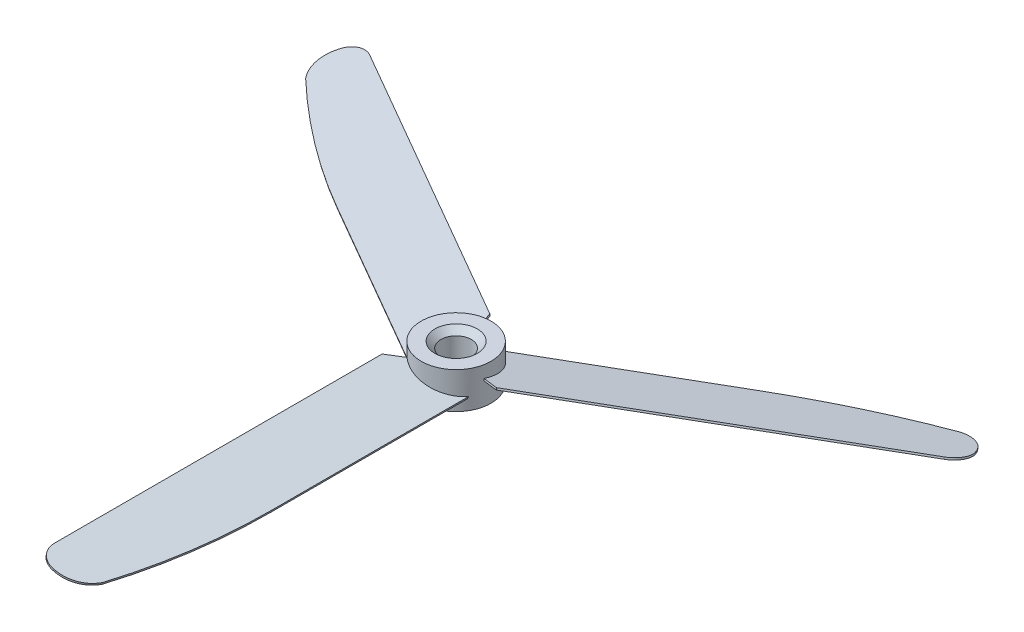
ISO-10303-21;
HEADER;
FILE_DESCRIPTION(('STEP AP214'),'2;1');
FILE_NAME('part.step','',(''),(''),'','','');
FILE_SCHEMA(('AUTOMOTIVE_DESIGN { 1 0 10303 214 1 1 1 1 }'));
ENDSEC;
DATA;
#1=APPLICATION_CONTEXT('core data for automotive mechanical design processes');
#2=APPLICATION_PROTOCOL_DEFINITION('international standard','automotive_design',2000,#1);
#3=PRODUCT_CONTEXT('',#1,'mechanical');
#4=PRODUCT('Part','Part','',(#3));
#5=PRODUCT_RELATED_PRODUCT_CATEGORY('part','',(#4));
#6=PRODUCT_DEFINITION_FORMATION('','',#4);
#7=PRODUCT_DEFINITION_CONTEXT('part definition',#1,'design');
#8=PRODUCT_DEFINITION('design','',#6,#7);
#9=PRODUCT_DEFINITION_SHAPE('','',#8);
#10=(LENGTH_UNIT() NAMED_UNIT(*) SI_UNIT(.MILLI.,.METRE.));
#11=(NAMED_UNIT(*) PLANE_ANGLE_UNIT() SI_UNIT($,.RADIAN.));
#12=(NAMED_UNIT(*) SI_UNIT($,.STERADIAN.) SOLID_ANGLE_UNIT());
#13=UNCERTAINTY_MEASURE_WITH_UNIT(LENGTH_MEASURE(1.E-05),#10,'distance_accuracy_value','');
#14=(GEOMETRIC_REPRESENTATION_CONTEXT(3) GLOBAL_UNCERTAINTY_ASSIGNED_CONTEXT((#13)) GLOBAL_UNIT_ASSIGNED_CONTEXT((#10,
#11,#12)) REPRESENTATION_CONTEXT('',''));
#15=CARTESIAN_POINT('',(0.,0.,0.));
#16=DIRECTION('',(0.,0.,1.));
#17=DIRECTION('',(1.,0.,0.));
#18=AXIS2_PLACEMENT_3D('',#15,#16,#17);
#19=CARTESIAN_POINT('',(0.,3.,0.));
#20=DIRECTION('',(0.,-1.,0.));
#21=DIRECTION('',(0.,0.,-1.));
#22=AXIS2_PLACEMENT_3D('',#19,#20,#21);
#23=CYLINDRICAL_SURFACE('',#22,5.75);
#24=CARTESIAN_POINT('',(0.,-22.4093869140777,0.));
#25=DIRECTION('',(0.487185032392622,0.224951054343865,0.843829228791101));
#26=DIRECTION('',(0.112475527171934,-0.974370064785235,0.194813327669881));
#27=AXIS2_PLACEMENT_3D('',#24,#25,#26);
#28=ELLIPSE('',#27,25.5611160248683,5.75);
#29=CARTESIAN_POINT('',(0.197285022953367,-1.28013719696289,-5.74661453550856));
#30=VERTEX_POINT('',#29);
#31=CARTESIAN_POINT('',(0.0674920929838222,-0.98782617752732,-5.74960388351969));
#32=VERTEX_POINT('',#31);
#33=EDGE_CURVE('E377',#30,#32,#28,.T.);
#34=ORIENTED_EDGE('',*,*,#33,.F.);
#35=CARTESIAN_POINT('',(0.,-0.153945616169009,0.));
#36=DIRECTION('',(0.112475527171934,-0.974370064785235,0.194813327669881));
#37=DIRECTION('',(-0.487185032392622,-0.224951054343865,-0.843829228791101));
#38=AXIS2_PLACEMENT_3D('',#35,#36,#37);
#39=ELLIPSE('',#38,5.901248619812,5.75);
#40=CARTESIAN_POINT('',(5.64774539742744,0.713843578539819,1.07957025053359));
#41=VERTEX_POINT('',#40);
#42=EDGE_CURVE('E335',#30,#41,#39,.T.);
#43=ORIENTED_EDGE('',*,*,#42,.T.);
#44=CARTESIAN_POINT('',(0.,-3.08350988501672,0.));
#45=DIRECTION('',(0.28567586359455,-0.156070821999763,-0.945532230799049));
#46=DIRECTION('',(-0.0451388037442194,-0.987745867376988,0.14940076932942));
#47=AXIS2_PLACEMENT_3D('',#44,#45,#46);
#48=ELLIPSE('',#47,36.8422484505703,5.75);
#49=CARTESIAN_POINT('',(5.65649072099047,1.01338707280666,1.03276944346197));
#50=VERTEX_POINT('',#49);
#51=EDGE_CURVE('E323',#50,#41,#48,.T.);
#52=ORIENTED_EDGE('',*,*,#51,.F.);
#53=CARTESIAN_POINT('',(0.,0.153945616169009,0.));
#54=DIRECTION('',(0.112475527171934,-0.974370064785235,0.194813327669881));
#55=DIRECTION('',(-0.487185032392622,-0.224951054343865,-0.843829228791101));
#56=AXIS2_PLACEMENT_3D('',#53,#54,#55);
#57=ELLIPSE('',#56,5.901248619812,5.75);
#58=EDGE_CURVE('E292',#32,#50,#57,.T.);
#59=ORIENTED_EDGE('',*,*,#58,.F.);
#60=EDGE_LOOP('',(#34,#43,#52,#59));
#61=FACE_BOUND('',#60,.T.);
#62=CARTESIAN_POINT('',(0.,-22.4093869140777,0.));
#63=DIRECTION('',(-0.974370064785235,0.224951054343865,0.));
#64=DIRECTION('',(-0.224951054343865,-0.974370064785235,0.));
#65=AXIS2_PLACEMENT_3D('',#62,#63,#64);
#66=ELLIPSE('',#65,25.5611160248683,5.75);
#67=CARTESIAN_POINT('',(4.87807166203063,-1.28013719696289,3.04416110941811));
#68=VERTEX_POINT('',#67);
#69=CARTESIAN_POINT('',(4.94555697833379,-0.98782617752732,2.93325180883844));
#70=VERTEX_POINT('',#69);
#71=EDGE_CURVE('E465',#68,#70,#66,.T.);
#72=ORIENTED_EDGE('',*,*,#71,.F.);
#73=CARTESIAN_POINT('',(0.,-0.153945616169009,0.));
#74=DIRECTION('',(-0.224951054343865,-0.974370064785235,0.));
#75=DIRECTION('',(0.974370064785235,-0.224951054343865,0.));
#76=AXIS2_PLACEMENT_3D('',#73,#74,#75);
#77=ELLIPSE('',#76,5.901248619812,5.75);
#78=CARTESIAN_POINT('',(-3.75880796084576,0.71384357853982,4.35130586301199));
#79=VERTEX_POINT('',#78);
#80=EDGE_CURVE('E469',#68,#79,#77,.T.);
#81=ORIENTED_EDGE('',*,*,#80,.T.);
#82=CARTESIAN_POINT('',(0.,-3.08350988501672,0.));
#83=DIRECTION('',(0.676017000171669,-0.156070821999763,0.720168670520466));
#84=DIRECTION('',(-0.106815459712106,-0.987745867376988,-0.113791735403645));
#85=AXIS2_PLACEMENT_3D('',#82,#83,#84);
#86=ELLIPSE('',#85,36.8422484505703,5.75);
#87=CARTESIAN_POINT('',(-3.72264993478564,1.01338707280666,4.3822799389177));
#88=VERTEX_POINT('',#87);
#89=EDGE_CURVE('E461',#88,#79,#86,.T.);
#90=ORIENTED_EDGE('',*,*,#89,.F.);
#91=CARTESIAN_POINT('',(0.,0.153945616169009,0.));
#92=DIRECTION('',(-0.224951054343865,-0.974370064785235,0.));
#93=DIRECTION('',(0.974370064785235,-0.224951054343865,0.));
#94=AXIS2_PLACEMENT_3D('',#91,#92,#93);
#95=ELLIPSE('',#94,5.901248619812,5.75);
#96=EDGE_CURVE('E454',#70,#88,#95,.T.);
#97=ORIENTED_EDGE('',*,*,#96,.F.);
#98=EDGE_LOOP('',(#72,#81,#90,#97));
#99=FACE_BOUND('',#98,.T.);
#100=CARTESIAN_POINT('',(0.,3.,0.));
#101=DIRECTION('',(0.,1.,0.));
#102=DIRECTION('',(0.,0.,1.));
#103=AXIS2_PLACEMENT_3D('',#100,#101,#102);
#104=CIRCLE('',#103,5.75);
#105=CARTESIAN_POINT('',(0.,3.,5.75));
#106=VERTEX_POINT('',#105);
#107=EDGE_CURVE('E450',#106,#106,#104,.T.);
#108=ORIENTED_EDGE('',*,*,#107,.F.);
#109=EDGE_LOOP('',(#108));
#110=FACE_BOUND('',#109,.T.);
#111=CARTESIAN_POINT('',(0.,-3.,0.));
#112=DIRECTION('',(0.,1.,0.));
#113=DIRECTION('',(0.,0.,1.));
#114=AXIS2_PLACEMENT_3D('',#111,#112,#113);
#115=CIRCLE('',#114,5.75);
#116=CARTESIAN_POINT('',(0.,-3.,5.75));
#117=VERTEX_POINT('',#116);
#118=EDGE_CURVE('E449',#117,#117,#115,.T.);
#119=ORIENTED_EDGE('',*,*,#118,.T.);
#120=EDGE_LOOP('',(#119));
#121=FACE_BOUND('',#120,.T.);
#122=CARTESIAN_POINT('',(0.,-22.4093869140777,0.));
#123=DIRECTION('',(0.48718503239261,0.224951054343865,-0.843829228791107));
#124=DIRECTION('',(0.112475527171931,-0.974370064785235,-0.194813327669882));
#125=AXIS2_PLACEMENT_3D('',#122,#123,#124);
#126=ELLIPSE('',#125,25.5611160248683,5.75);
#127=CARTESIAN_POINT('',(-5.075356684984,-1.28013719696289,2.70245342609049));
#128=VERTEX_POINT('',#127);
#129=CARTESIAN_POINT('',(-5.01304907131761,-0.98782617752732,2.81635207468129));
#130=VERTEX_POINT('',#129);
#131=EDGE_CURVE('E58',#128,#130,#126,.T.);
#132=ORIENTED_EDGE('',*,*,#131,.F.);
#133=CARTESIAN_POINT('',(0.,-0.153945616169009,0.));
#134=DIRECTION('',(0.112475527171931,-0.974370064785235,-0.194813327669882));
#135=DIRECTION('',(-0.48718503239261,-0.224951054343865,0.843829228791108));
#136=AXIS2_PLACEMENT_3D('',#133,#134,#135);
#137=ELLIPSE('',#136,5.901248619812,5.75);
#138=CARTESIAN_POINT('',(-1.88893743658173,0.713843578539818,-5.43087611354559));
#139=VERTEX_POINT('',#138);
#140=EDGE_CURVE('E62',#128,#139,#137,.T.);
#141=ORIENTED_EDGE('',*,*,#140,.T.);
#142=CARTESIAN_POINT('',(0.,-3.08350988501672,0.));
#143=DIRECTION('',(-0.961692863766222,-0.156070821999763,0.225363560278591));
#144=DIRECTION('',(0.151954263456326,-0.987745867376988,-0.0356090339257766));
#145=AXIS2_PLACEMENT_3D('',#142,#143,#144);
#146=ELLIPSE('',#145,36.8422484505703,5.75);
#147=CARTESIAN_POINT('',(-1.93384078620488,1.01338707280666,-5.41504938237968));
#148=VERTEX_POINT('',#147);
#149=EDGE_CURVE('E199',#148,#139,#146,.T.);
#150=ORIENTED_EDGE('',*,*,#149,.F.);
#151=CARTESIAN_POINT('',(0.,0.153945616169009,0.));
#152=DIRECTION('',(0.112475527171931,-0.974370064785235,-0.194813327669882));
#153=DIRECTION('',(-0.48718503239261,-0.224951054343865,0.843829228791108));
#154=AXIS2_PLACEMENT_3D('',#151,#152,#153);
#155=ELLIPSE('',#154,5.901248619812,5.75);
#156=EDGE_CURVE('E201',#130,#148,#155,.T.);
#157=ORIENTED_EDGE('',*,*,#156,.F.);
#158=EDGE_LOOP('',(#132,#141,#150,#157));
#159=FACE_BOUND('',#158,.T.);
#160=ADVANCED_FACE('F41',(#61,#99,#110,#121,#159),#23,.T.);
#161=CARTESIAN_POINT('',(0.,3.,0.));
#162=DIRECTION('',(0.,1.,0.));
#163=DIRECTION('',(0.,0.,1.));
#164=AXIS2_PLACEMENT_3D('',#161,#162,#163);
#165=PLANE('',#164);
#166=CARTESIAN_POINT('',(0.,3.,0.));
#167=DIRECTION('',(0.,1.,0.));
#168=DIRECTION('',(0.,0.,1.));
#169=AXIS2_PLACEMENT_3D('',#166,#167,#168);
#170=CIRCLE('',#169,3.50000000000002);
#171=CARTESIAN_POINT('',(0.,3.,3.50000000000002));
#172=VERTEX_POINT('',#171);
#173=EDGE_CURVE('E11',#172,#172,#170,.F.);
#174=ORIENTED_EDGE('',*,*,#173,.T.);
#175=EDGE_LOOP('',(#174));
#176=FACE_BOUND('',#175,.T.);
#177=ORIENTED_EDGE('',*,*,#107,.T.);
#178=EDGE_LOOP('',(#177));
#179=FACE_BOUND('',#178,.T.);
#180=ADVANCED_FACE('F501',(#176,#179),#165,.T.);
#181=CARTESIAN_POINT('',(0.,-3.,0.));
#182=DIRECTION('',(0.,1.,0.));
#183=DIRECTION('',(0.,0.,1.));
#184=AXIS2_PLACEMENT_3D('',#181,#182,#183);
#185=PLANE('',#184);
#186=CARTESIAN_POINT('',(0.,-3.,0.));
#187=DIRECTION('',(0.,1.,0.));
#188=DIRECTION('',(0.,0.,1.));
#189=AXIS2_PLACEMENT_3D('',#186,#187,#188);
#190=CIRCLE('',#189,3.49999999999999);
#191=CARTESIAN_POINT('',(0.,-3.,3.49999999999999));
#192=VERTEX_POINT('',#191);
#193=EDGE_CURVE('E51',#192,#192,#190,.T.);
#194=ORIENTED_EDGE('',*,*,#193,.T.);
#195=EDGE_LOOP('',(#194));
#196=FACE_BOUND('',#195,.T.);
#197=ORIENTED_EDGE('',*,*,#118,.F.);
#198=EDGE_LOOP('',(#197));
#199=FACE_BOUND('',#198,.T.);
#200=ADVANCED_FACE('F483',(#196,#199),#185,.F.);
#201=CARTESIAN_POINT('',(4.87807166203063,-1.28013719696289,1.39631008391547));
#202=DIRECTION('',(-0.974370064785235,0.224951054343865,0.));
#203=DIRECTION('',(-0.224951054343865,-0.974370064785235,0.));
#204=AXIS2_PLACEMENT_3D('',#201,#202,#203);
#205=PLANE('',#204);
#206=DIRECTION('',(0.,0.,1.));
#207=VECTOR('',#206,1.);
#208=CARTESIAN_POINT('',(4.87807166203063,-1.28013719696289,1.39631008391547));
#209=LINE('',#208,#207);
#210=CARTESIAN_POINT('',(4.87807166203063,-1.28013719696289,35.2692560502776));
#211=VERTEX_POINT('',#210);
#212=EDGE_CURVE('E382',#68,#211,#209,.T.);
#213=ORIENTED_EDGE('',*,*,#212,.F.);
#214=ORIENTED_EDGE('',*,*,#71,.T.);
#215=DIRECTION('',(0.,0.,1.));
#216=VECTOR('',#215,1.);
#217=CARTESIAN_POINT('',(4.94555697833379,-0.98782617752732,1.39631008391547));
#218=LINE('',#217,#216);
#219=CARTESIAN_POINT('',(4.94555697833379,-0.98782617752732,35.2692560502776));
#220=VERTEX_POINT('',#219);
#221=EDGE_CURVE('E381',#70,#220,#218,.T.);
#222=ORIENTED_EDGE('',*,*,#221,.T.);
#223=DIRECTION('',(0.224951054343865,0.974370064785235,0.));
#224=VECTOR('',#223,1.);
#225=CARTESIAN_POINT('',(4.87807166203063,-1.28013719696289,35.2692560502776));
#226=LINE('',#225,#224);
#227=EDGE_CURVE('E445',#211,#220,#226,.T.);
#228=ORIENTED_EDGE('',*,*,#227,.F.);
#229=EDGE_LOOP('',(#213,#214,#222,#228));
#230=FACE_BOUND('',#229,.T.);
#231=ADVANCED_FACE('F513',(#230),#205,.F.);
#232=CARTESIAN_POINT('',(-97.7036696202623,22.4027238553906,35.2692560502776));
#233=DIRECTION('',(0.224951054343865,0.974370064785235,0.));
#234=DIRECTION('',(-0.974370064785235,0.224951054343865,0.));
#235=AXIS2_PLACEMENT_3D('',#232,#233,#234);
#236=CYLINDRICAL_SURFACE('',#235,105.280062462616);
#237=CARTESIAN_POINT('',(-97.6361843039592,22.6950348748262,35.2692560502776));
#238=DIRECTION('',(-0.224951054343865,-0.974370064785235,0.));
#239=DIRECTION('',(0.974370064785235,-0.224951054343865,0.));
#240=AXIS2_PLACEMENT_3D('',#237,#238,#239);
#241=CIRCLE('',#240,105.280062462616);
#242=CARTESIAN_POINT('',(2.00656740607946,-0.309306971244069,60.2895246342299));
#243=VERTEX_POINT('',#242);
#244=EDGE_CURVE('E408',#220,#243,#241,.T.);
#245=ORIENTED_EDGE('',*,*,#244,.T.);
#246=DIRECTION('',(0.224951054343865,0.974370064785235,0.));
#247=VECTOR('',#246,1.);
#248=CARTESIAN_POINT('',(1.9390820897763,-0.601617990679639,60.2895246342299));
#249=LINE('',#248,#247);
#250=CARTESIAN_POINT('',(1.9390820897763,-0.601617990679639,60.2895246342299));
#251=VERTEX_POINT('',#250);
#252=EDGE_CURVE('E441',#251,#243,#249,.T.);
#253=ORIENTED_EDGE('',*,*,#252,.F.);
#254=CARTESIAN_POINT('',(-97.7036696202623,22.4027238553906,35.2692560502776));
#255=DIRECTION('',(-0.224951054343865,-0.974370064785235,0.));
#256=DIRECTION('',(0.974370064785235,-0.224951054343865,0.));
#257=AXIS2_PLACEMENT_3D('',#254,#255,#256);
#258=CIRCLE('',#257,105.280062462616);
#259=EDGE_CURVE('E385',#211,#251,#258,.T.);
#260=ORIENTED_EDGE('',*,*,#259,.F.);
#261=ORIENTED_EDGE('',*,*,#227,.T.);
#262=EDGE_LOOP('',(#245,#253,#260,#261));
#263=FACE_BOUND('',#262,.T.);
#264=ADVANCED_FACE('F518',(#263),#236,.T.);
#265=CARTESIAN_POINT('',(-2.61004728353909,0.448631278933851,58.5));
#266=DIRECTION('',(0.224951054343865,0.974370064785235,0.));
#267=DIRECTION('',(-0.974370064785235,0.224951054343865,0.));
#268=AXIS2_PLACEMENT_3D('',#265,#266,#267);
#269=CYLINDRICAL_SURFACE('',#268,5.);
#270=CARTESIAN_POINT('',(-2.54256196723593,0.740942298369422,58.5));
#271=DIRECTION('',(-0.224951054343865,-0.974370064785235,0.));
#272=DIRECTION('',(0.974370064785235,-0.224951054343865,0.));
#273=AXIS2_PLACEMENT_3D('',#270,#271,#272);
#274=CIRCLE('',#273,5.);
#275=CARTESIAN_POINT('',(-2.54256196723593,0.740942298369422,63.5));
#276=VERTEX_POINT('',#275);
#277=EDGE_CURVE('E411',#243,#276,#274,.T.);
#278=ORIENTED_EDGE('',*,*,#277,.T.);
#279=DIRECTION('',(0.224951054343865,0.974370064785235,0.));
#280=VECTOR('',#279,1.);
#281=CARTESIAN_POINT('',(-2.61004728353909,0.448631278933851,63.5));
#282=LINE('',#281,#280);
#283=CARTESIAN_POINT('',(-2.61004728353909,0.448631278933851,63.5));
#284=VERTEX_POINT('',#283);
#285=EDGE_CURVE('E437',#284,#276,#282,.T.);
#286=ORIENTED_EDGE('',*,*,#285,.F.);
#287=CARTESIAN_POINT('',(-2.61004728353909,0.448631278933851,58.5));
#288=DIRECTION('',(-0.224951054343865,-0.974370064785235,0.));
#289=DIRECTION('',(0.974370064785235,-0.224951054343865,0.));
#290=AXIS2_PLACEMENT_3D('',#287,#288,#289);
#291=CIRCLE('',#290,5.);
#292=EDGE_CURVE('E389',#251,#284,#291,.T.);
#293=ORIENTED_EDGE('',*,*,#292,.F.);
#294=ORIENTED_EDGE('',*,*,#252,.T.);
#295=EDGE_LOOP('',(#278,#286,#293,#294));
#296=FACE_BOUND('',#295,.T.);
#297=ADVANCED_FACE('F529',(#296),#269,.T.);
#298=CARTESIAN_POINT('',(-2.92518145897441,0.52138573597845,63.5));
#299=DIRECTION('',(0.,0.,-1.));
#300=DIRECTION('',(-1.,0.,0.));
#301=AXIS2_PLACEMENT_3D('',#298,#299,#300);
#302=PLANE('',#301);
#303=DIRECTION('',(-0.974370064785235,0.224951054343866,0.));
#304=VECTOR('',#303,1.);
#305=CARTESIAN_POINT('',(-2.85769614267125,0.81369675541402,63.5));
#306=LINE('',#305,#304);
#307=CARTESIAN_POINT('',(-2.85769614267125,0.81369675541402,63.5));
#308=VERTEX_POINT('',#307);
#309=EDGE_CURVE('E414',#276,#308,#306,.T.);
#310=ORIENTED_EDGE('',*,*,#309,.T.);
#311=DIRECTION('',(0.224951054343865,0.974370064785235,0.));
#312=VECTOR('',#311,1.);
#313=CARTESIAN_POINT('',(-2.92518145897441,0.52138573597845,63.5));
#314=LINE('',#313,#312);
#315=CARTESIAN_POINT('',(-2.92518145897441,0.52138573597845,63.5));
#316=VERTEX_POINT('',#315);
#317=EDGE_CURVE('E433',#316,#308,#314,.T.);
#318=ORIENTED_EDGE('',*,*,#317,.F.);
#319=DIRECTION('',(-0.974370064785235,0.224951054343866,0.));
#320=VECTOR('',#319,1.);
#321=CARTESIAN_POINT('',(-2.92518145897441,0.52138573597845,63.5));
#322=LINE('',#321,#320);
#323=EDGE_CURVE('E392',#284,#316,#322,.T.);
#324=ORIENTED_EDGE('',*,*,#323,.F.);
#325=ORIENTED_EDGE('',*,*,#285,.T.);
#326=EDGE_LOOP('',(#310,#318,#324,#325));
#327=FACE_BOUND('',#326,.T.);
#328=ADVANCED_FACE('F533',(#327),#302,.F.);
#329=CARTESIAN_POINT('',(-2.92518145897441,0.52138573597845,60.5));
#330=DIRECTION('',(0.224951054343865,0.974370064785235,0.));
#331=DIRECTION('',(-0.974370064785235,0.224951054343865,0.));
#332=AXIS2_PLACEMENT_3D('',#329,#330,#331);
#333=CYLINDRICAL_SURFACE('',#332,3.);
#334=CARTESIAN_POINT('',(-2.85769614267125,0.81369675541402,60.5));
#335=DIRECTION('',(-0.224951054343865,-0.974370064785235,0.));
#336=DIRECTION('',(-0.974370064785235,0.224951054343865,0.));
#337=AXIS2_PLACEMENT_3D('',#334,#335,#336);
#338=CIRCLE('',#337,3.);
#339=CARTESIAN_POINT('',(-5.78080633702696,1.48854991844562,60.5));
#340=VERTEX_POINT('',#339);
#341=EDGE_CURVE('E417',#308,#340,#338,.T.);
#342=ORIENTED_EDGE('',*,*,#341,.T.);
#343=DIRECTION('',(0.224951054343865,0.974370064785235,0.));
#344=VECTOR('',#343,1.);
#345=CARTESIAN_POINT('',(-5.84829165333012,1.19623889901005,60.5));
#346=LINE('',#345,#344);
#347=CARTESIAN_POINT('',(-5.84829165333012,1.19623889901005,60.5));
#348=VERTEX_POINT('',#347);
#349=EDGE_CURVE('E429',#348,#340,#346,.T.);
#350=ORIENTED_EDGE('',*,*,#349,.F.);
#351=CARTESIAN_POINT('',(-2.92518145897441,0.52138573597845,60.5));
#352=DIRECTION('',(-0.224951054343865,-0.974370064785235,0.));
#353=DIRECTION('',(-0.974370064785235,0.224951054343865,0.));
#354=AXIS2_PLACEMENT_3D('',#351,#352,#353);
#355=CIRCLE('',#354,3.);
#356=EDGE_CURVE('E395',#316,#348,#355,.T.);
#357=ORIENTED_EDGE('',*,*,#356,.F.);
#358=ORIENTED_EDGE('',*,*,#317,.T.);
#359=EDGE_LOOP('',(#342,#350,#357,#358));
#360=FACE_BOUND('',#359,.T.);
#361=ADVANCED_FACE('F537',(#360),#333,.T.);
#362=CARTESIAN_POINT('',(-5.84829165333012,1.19623889901005,6.41723068423516));
#363=DIRECTION('',(0.974370064785235,-0.224951054343865,0.));
#364=DIRECTION('',(0.224951054343865,0.974370064785235,0.));
#365=AXIS2_PLACEMENT_3D('',#362,#363,#364);
#366=PLANE('',#365);
#367=DIRECTION('',(0.,0.,-1.));
#368=VECTOR('',#367,1.);
#369=CARTESIAN_POINT('',(-5.78080633702696,1.48854991844562,6.41723068423516));
#370=LINE('',#369,#368);
#371=CARTESIAN_POINT('',(-5.78080633702696,1.48854991844562,6.41723068423516));
#372=VERTEX_POINT('',#371);
#373=EDGE_CURVE('E420',#340,#372,#370,.T.);
#374=ORIENTED_EDGE('',*,*,#373,.T.);
#375=DIRECTION('',(0.224951054343865,0.974370064785235,0.));
#376=VECTOR('',#375,1.);
#377=CARTESIAN_POINT('',(-5.84829165333012,1.19623889901005,6.41723068423516));
#378=LINE('',#377,#376);
#379=CARTESIAN_POINT('',(-5.84829165333012,1.19623889901005,6.41723068423516));
#380=VERTEX_POINT('',#379);
#381=EDGE_CURVE('E405',#380,#372,#378,.T.);
#382=ORIENTED_EDGE('',*,*,#381,.F.);
#383=DIRECTION('',(0.,0.,-1.));
#384=VECTOR('',#383,1.);
#385=CARTESIAN_POINT('',(-5.84829165333012,1.19623889901005,6.41723068423516));
#386=LINE('',#385,#384);
#387=EDGE_CURVE('E398',#348,#380,#386,.T.);
#388=ORIENTED_EDGE('',*,*,#387,.F.);
#389=ORIENTED_EDGE('',*,*,#349,.T.);
#390=EDGE_LOOP('',(#374,#382,#388,#389));
#391=FACE_BOUND('',#390,.T.);
#392=ADVANCED_FACE('F541',(#391),#366,.F.);
#393=CARTESIAN_POINT('',(-3.34779996420568,0.618954905817382,3.94493197024886));
#394=DIRECTION('',(0.676017000171669,-0.156070821999763,0.720168670520466));
#395=DIRECTION('',(0.729103197802196,0.,-0.684403774795706));
#396=AXIS2_PLACEMENT_3D('',#393,#394,#395);
#397=PLANE('',#396);
#398=DIRECTION('',(0.701710794151323,-0.162002701738999,-0.69379902421435));
#399=VECTOR('',#398,1.);
#400=CARTESIAN_POINT('',(-3.28031464790252,0.911265925252953,3.94493197024886));
#401=LINE('',#400,#399);
#402=EDGE_CURVE('E386',#372,#88,#401,.T.);
#403=ORIENTED_EDGE('',*,*,#402,.T.);
#404=ORIENTED_EDGE('',*,*,#89,.T.);
#405=DIRECTION('',(0.701710794151323,-0.162002701738999,-0.69379902421435));
#406=VECTOR('',#405,1.);
#407=CARTESIAN_POINT('',(-3.34779996420568,0.618954905817382,3.94493197024886));
#408=LINE('',#407,#406);
#409=EDGE_CURVE('E401',#380,#79,#408,.T.);
#410=ORIENTED_EDGE('',*,*,#409,.F.);
#411=ORIENTED_EDGE('',*,*,#381,.T.);
#412=EDGE_LOOP('',(#403,#404,#410,#411));
#413=FACE_BOUND('',#412,.T.);
#414=ADVANCED_FACE('F545',(#413),#397,.F.);
#415=CARTESIAN_POINT('',(1.1698706609464,-0.424031539512572,5.10379948765416));
#416=DIRECTION('',(-0.224951054343865,-0.974370064785235,0.));
#417=DIRECTION('',(0.974370064785235,-0.224951054343865,0.));
#418=AXIS2_PLACEMENT_3D('',#415,#416,#417);
#419=PLANE('',#418);
#420=ORIENTED_EDGE('',*,*,#80,.F.);
#421=ORIENTED_EDGE('',*,*,#212,.T.);
#422=ORIENTED_EDGE('',*,*,#259,.T.);
#423=ORIENTED_EDGE('',*,*,#292,.T.);
#424=ORIENTED_EDGE('',*,*,#323,.T.);
#425=ORIENTED_EDGE('',*,*,#356,.T.);
#426=ORIENTED_EDGE('',*,*,#387,.T.);
#427=ORIENTED_EDGE('',*,*,#409,.T.);
#428=EDGE_LOOP('',(#420,#421,#422,#423,#424,#425,#426,#427));
#429=FACE_BOUND('',#428,.T.);
#430=ADVANCED_FACE('F549',(#429),#419,.T.);
#431=CARTESIAN_POINT('',(1.23735597724956,-0.131720520077001,5.10379948765416));
#432=DIRECTION('',(-0.224951054343865,-0.974370064785235,0.));
#433=DIRECTION('',(0.974370064785235,-0.224951054343865,0.));
#434=AXIS2_PLACEMENT_3D('',#431,#432,#433);
#435=PLANE('',#434);
#436=ORIENTED_EDGE('',*,*,#221,.F.);
#437=ORIENTED_EDGE('',*,*,#96,.T.);
#438=ORIENTED_EDGE('',*,*,#402,.F.);
#439=ORIENTED_EDGE('',*,*,#373,.F.);
#440=ORIENTED_EDGE('',*,*,#341,.F.);
#441=ORIENTED_EDGE('',*,*,#309,.F.);
#442=ORIENTED_EDGE('',*,*,#277,.F.);
#443=ORIENTED_EDGE('',*,*,#244,.F.);
#444=EDGE_LOOP('',(#436,#437,#438,#439,#440,#441,#442,#443));
#445=FACE_BOUND('',#444,.T.);
#446=ADVANCED_FACE('F551',(#445),#435,.F.);
#447=CARTESIAN_POINT('',(-1.22979582678416,-1.28013719696289,-4.92268902275723));
#448=DIRECTION('',(0.487185032392622,0.224951054343865,0.843829228791101));
#449=DIRECTION('',(0.112475527171934,-0.974370064785235,0.194813327669881));
#450=AXIS2_PLACEMENT_3D('',#447,#448,#449);
#451=PLANE('',#450);
#452=DIRECTION('',(0.866025403784436,0.,-0.500000000000004));
#453=VECTOR('',#452,1.);
#454=CARTESIAN_POINT('',(-1.22979582678416,-1.28013719696289,-4.92268902275723));
#455=LINE('',#454,#453);
#456=CARTESIAN_POINT('',(28.105035881103,-1.28013719696289,-21.8591620059384));
#457=VERTEX_POINT('',#456);
#458=EDGE_CURVE('E338',#30,#457,#455,.T.);
#459=ORIENTED_EDGE('',*,*,#458,.F.);
#460=ORIENTED_EDGE('',*,*,#33,.T.);
#461=DIRECTION('',(0.866025403784436,0.,-0.500000000000004));
#462=VECTOR('',#461,1.);
#463=CARTESIAN_POINT('',(-1.26353848493574,-0.98782617752732,-4.9811330210582));
#464=LINE('',#463,#462);
#465=CARTESIAN_POINT('',(28.0712932229514,-0.98782617752732,-21.9176060042394));
#466=VERTEX_POINT('',#465);
#467=EDGE_CURVE('E296',#32,#466,#464,.T.);
#468=ORIENTED_EDGE('',*,*,#467,.T.);
#469=DIRECTION('',(-0.112475527171934,0.974370064785235,-0.194813327669881));
#470=VECTOR('',#469,1.);
#471=CARTESIAN_POINT('',(28.105035881103,-1.28013719696289,-21.8591620059384));
#472=LINE('',#471,#470);
#473=EDGE_CURVE('E373',#457,#466,#472,.T.);
#474=ORIENTED_EDGE('',*,*,#473,.F.);
#475=EDGE_LOOP('',(#459,#460,#468,#474));
#476=FACE_BOUND('',#475,.T.);
#477=ADVANCED_FACE('F554',(#476),#451,.F.);
#478=CARTESIAN_POINT('',(79.3959065222499,22.4027238553906,66.9792319089699));
#479=DIRECTION('',(-0.112475527171934,0.974370064785235,-0.194813327669881));
#480=DIRECTION('',(0.487185032392622,0.224951054343865,0.843829228791101));
#481=AXIS2_PLACEMENT_3D('',#478,#479,#480);
#482=CYLINDRICAL_SURFACE('',#481,105.280062462616);
#483=CARTESIAN_POINT('',(79.3621638640983,22.6950348748262,66.920787910669));
#484=DIRECTION('',(0.112475527171934,-0.974370064785235,0.194813327669881));
#485=DIRECTION('',(-0.487185032392622,-0.224951054343865,-0.843829228791101));
#486=AXIS2_PLACEMENT_3D('',#483,#484,#485);
#487=CIRCLE('',#486,105.280062462616);
#488=CARTESIAN_POINT('',(51.2089762122909,-0.309306971244069,-31.8825006651859));
#489=VERTEX_POINT('',#488);
#490=EDGE_CURVE('E319',#466,#489,#487,.T.);
#491=ORIENTED_EDGE('',*,*,#490,.T.);
#492=DIRECTION('',(-0.112475527171934,0.974370064785235,-0.194813327669881));
#493=VECTOR('',#492,1.);
#494=CARTESIAN_POINT('',(51.2427188704425,-0.601617990679639,-31.8240566668849));
#495=LINE('',#494,#493);
#496=CARTESIAN_POINT('',(51.2427188704425,-0.601617990679639,-31.8240566668849));
#497=VERTEX_POINT('',#496);
#498=EDGE_CURVE('E369',#497,#489,#495,.T.);
#499=ORIENTED_EDGE('',*,*,#498,.F.);
#500=CARTESIAN_POINT('',(79.3959065222499,22.4027238553906,66.9792319089699));
#501=DIRECTION('',(0.112475527171934,-0.974370064785235,0.194813327669881));
#502=DIRECTION('',(-0.487185032392622,-0.224951054343865,-0.843829228791101));
#503=AXIS2_PLACEMENT_3D('',#500,#501,#502);
#504=CIRCLE('',#503,105.280062462616);
#505=EDGE_CURVE('E341',#457,#497,#504,.T.);
#506=ORIENTED_EDGE('',*,*,#505,.F.);
#507=ORIENTED_EDGE('',*,*,#473,.T.);
#508=EDGE_LOOP('',(#491,#499,#506,#507));
#509=FACE_BOUND('',#508,.T.);
#510=ADVANCED_FACE('F561',(#509),#482,.T.);
#511=CARTESIAN_POINT('',(51.9675097631591,0.448631278933851,-26.9896327473768));
#512=DIRECTION('',(-0.112475527171934,0.974370064785235,-0.194813327669881));
#513=DIRECTION('',(0.487185032392622,0.224951054343865,0.843829228791101));
#514=AXIS2_PLACEMENT_3D('',#511,#512,#513);
#515=CYLINDRICAL_SURFACE('',#514,5.);
#516=CARTESIAN_POINT('',(51.9337671050075,0.740942298369422,-27.0480767456778));
#517=DIRECTION('',(0.112475527171934,-0.974370064785235,0.194813327669881));
#518=DIRECTION('',(-0.487185032392622,-0.224951054343865,-0.843829228791101));
#519=AXIS2_PLACEMENT_3D('',#516,#517,#518);
#520=CIRCLE('',#519,5.);
#521=CARTESIAN_POINT('',(56.2638941239297,0.740942298369422,-29.5480767456778));
#522=VERTEX_POINT('',#521);
#523=EDGE_CURVE('E315',#489,#522,#520,.T.);
#524=ORIENTED_EDGE('',*,*,#523,.T.);
#525=DIRECTION('',(-0.112475527171934,0.974370064785235,-0.194813327669881));
#526=VECTOR('',#525,1.);
#527=CARTESIAN_POINT('',(56.2976367820813,0.448631278933851,-29.4896327473769));
#528=LINE('',#527,#526);
#529=CARTESIAN_POINT('',(56.2976367820813,0.448631278933851,-29.4896327473769));
#530=VERTEX_POINT('',#529);
#531=EDGE_CURVE('E365',#530,#522,#528,.T.);
#532=ORIENTED_EDGE('',*,*,#531,.F.);
#533=CARTESIAN_POINT('',(51.9675097631591,0.448631278933851,-26.9896327473768));
#534=DIRECTION('',(0.112475527171934,-0.974370064785235,0.194813327669881));
#535=DIRECTION('',(-0.487185032392622,-0.224951054343865,-0.843829228791101));
#536=AXIS2_PLACEMENT_3D('',#533,#534,#535);
#537=CIRCLE('',#536,5.);
#538=EDGE_CURVE('E344',#497,#530,#537,.T.);
#539=ORIENTED_EDGE('',*,*,#538,.F.);
#540=ORIENTED_EDGE('',*,*,#498,.T.);
#541=EDGE_LOOP('',(#524,#532,#539,#540));
#542=FACE_BOUND('',#541,.T.);
#543=ADVANCED_FACE('F565',(#542),#515,.T.);
#544=CARTESIAN_POINT('',(56.4552038697989,0.52138573597845,-29.2167185458492));
#545=DIRECTION('',(-0.866025403784436,0.,0.500000000000004));
#546=DIRECTION('',(0.500000000000004,0.,0.866025403784436));
#547=AXIS2_PLACEMENT_3D('',#544,#545,#546);
#548=PLANE('',#547);
#549=DIRECTION('',(0.487185032392622,0.224951054343866,0.843829228791101));
#550=VECTOR('',#549,1.);
#551=CARTESIAN_POINT('',(56.4214612116474,0.81369675541402,-29.2751625441502));
#552=LINE('',#551,#550);
#553=CARTESIAN_POINT('',(56.4214612116474,0.81369675541402,-29.2751625441502));
#554=VERTEX_POINT('',#553);
#555=EDGE_CURVE('E311',#522,#554,#552,.T.);
#556=ORIENTED_EDGE('',*,*,#555,.T.);
#557=DIRECTION('',(-0.112475527171934,0.974370064785235,-0.194813327669881));
#558=VECTOR('',#557,1.);
#559=CARTESIAN_POINT('',(56.4552038697989,0.52138573597845,-29.2167185458492));
#560=LINE('',#559,#558);
#561=CARTESIAN_POINT('',(56.4552038697989,0.52138573597845,-29.2167185458492));
#562=VERTEX_POINT('',#561);
#563=EDGE_CURVE('E361',#562,#554,#560,.T.);
#564=ORIENTED_EDGE('',*,*,#563,.F.);
#565=DIRECTION('',(0.487185032392622,0.224951054343866,0.843829228791101));
#566=VECTOR('',#565,1.);
#567=CARTESIAN_POINT('',(56.4552038697989,0.52138573597845,-29.2167185458492));
#568=LINE('',#567,#566);
#569=EDGE_CURVE('E347',#530,#562,#568,.T.);
#570=ORIENTED_EDGE('',*,*,#569,.F.);
#571=ORIENTED_EDGE('',*,*,#531,.T.);
#572=EDGE_LOOP('',(#556,#564,#570,#571));
#573=FACE_BOUND('',#572,.T.);
#574=ADVANCED_FACE('F569',(#573),#548,.F.);
#575=CARTESIAN_POINT('',(53.8571276584456,0.52138573597845,-27.7167185458492));
#576=DIRECTION('',(-0.112475527171934,0.974370064785235,-0.194813327669881));
#577=DIRECTION('',(0.487185032392622,0.224951054343865,0.843829228791101));
#578=AXIS2_PLACEMENT_3D('',#575,#576,#577);
#579=CYLINDRICAL_SURFACE('',#578,3.);
#580=CARTESIAN_POINT('',(53.823385000294,0.81369675541402,-27.7751625441502));
#581=DIRECTION('',(0.112475527171934,-0.974370064785235,0.194813327669881));
#582=DIRECTION('',(0.487185032392622,0.224951054343865,0.843829228791101));
#583=AXIS2_PLACEMENT_3D('',#580,#581,#582);
#584=CIRCLE('',#583,3.);
#585=CARTESIAN_POINT('',(55.2849400974719,1.48854991844562,-25.2436748577768));
#586=VERTEX_POINT('',#585);
#587=EDGE_CURVE('E307',#554,#586,#584,.T.);
#588=ORIENTED_EDGE('',*,*,#587,.T.);
#589=DIRECTION('',(-0.112475527171934,0.974370064785235,-0.194813327669881));
#590=VECTOR('',#589,1.);
#591=CARTESIAN_POINT('',(55.3186827556235,1.19623889901005,-25.1852308594759));
#592=LINE('',#591,#590);
#593=CARTESIAN_POINT('',(55.3186827556235,1.19623889901005,-25.1852308594759));
#594=VERTEX_POINT('',#593);
#595=EDGE_CURVE('E357',#594,#586,#592,.T.);
#596=ORIENTED_EDGE('',*,*,#595,.F.);
#597=CARTESIAN_POINT('',(53.8571276584456,0.52138573597845,-27.7167185458492));
#598=DIRECTION('',(0.112475527171934,-0.974370064785235,0.194813327669881));
#599=DIRECTION('',(0.487185032392622,0.224951054343865,0.843829228791101));
#600=AXIS2_PLACEMENT_3D('',#597,#598,#599);
#601=CIRCLE('',#600,3.);
#602=EDGE_CURVE('E350',#562,#594,#601,.T.);
#603=ORIENTED_EDGE('',*,*,#602,.F.);
#604=ORIENTED_EDGE('',*,*,#563,.T.);
#605=EDGE_LOOP('',(#588,#596,#603,#604));
#606=FACE_BOUND('',#605,.T.);
#607=ADVANCED_FACE('F573',(#606),#579,.T.);
#608=CARTESIAN_POINT('',(8.48163062115772,1.19623889901005,1.85615379840675));
#609=DIRECTION('',(-0.487185032392622,-0.224951054343865,-0.843829228791101));
#610=DIRECTION('',(-0.112475527171934,0.974370064785235,-0.194813327669881));
#611=AXIS2_PLACEMENT_3D('',#608,#609,#610);
#612=PLANE('',#611);
#613=DIRECTION('',(-0.866025403784436,0.,0.500000000000004));
#614=VECTOR('',#613,1.);
#615=CARTESIAN_POINT('',(8.44788796300614,1.48854991844562,1.79770980010579));
#616=LINE('',#615,#614);
#617=CARTESIAN_POINT('',(8.44788796300614,1.48854991844562,1.79770980010579));
#618=VERTEX_POINT('',#617);
#619=EDGE_CURVE('E303',#586,#618,#616,.T.);
#620=ORIENTED_EDGE('',*,*,#619,.T.);
#621=DIRECTION('',(-0.112475527171934,0.974370064785235,-0.194813327669881));
#622=VECTOR('',#621,1.);
#623=CARTESIAN_POINT('',(8.48163062115772,1.19623889901005,1.85615379840675));
#624=LINE('',#623,#622);
#625=CARTESIAN_POINT('',(8.48163062115772,1.19623889901005,1.85615379840675));
#626=VERTEX_POINT('',#625);
#627=EDGE_CURVE('E331',#626,#618,#624,.T.);
#628=ORIENTED_EDGE('',*,*,#627,.F.);
#629=DIRECTION('',(-0.866025403784436,0.,0.500000000000004));
#630=VECTOR('',#629,1.);
#631=CARTESIAN_POINT('',(8.48163062115772,1.19623889901005,1.85615379840675));
#632=LINE('',#631,#630);
#633=EDGE_CURVE('E353',#594,#626,#632,.T.);
#634=ORIENTED_EDGE('',*,*,#633,.F.);
#635=ORIENTED_EDGE('',*,*,#595,.T.);
#636=EDGE_LOOP('',(#620,#628,#634,#635));
#637=FACE_BOUND('',#636,.T.);
#638=ADVANCED_FACE('F577',(#637),#612,.F.);
#639=CARTESIAN_POINT('',(3.83508468165729,-0.424031539512572,-3.56503745534877));
#640=DIRECTION('',(0.112475527171934,-0.974370064785235,0.194813327669881));
#641=DIRECTION('',(-0.487185032392622,-0.224951054343865,-0.843829228791101));
#642=AXIS2_PLACEMENT_3D('',#639,#640,#641);
#643=PLANE('',#642);
#644=ORIENTED_EDGE('',*,*,#42,.F.);
#645=ORIENTED_EDGE('',*,*,#458,.T.);
#646=ORIENTED_EDGE('',*,*,#505,.T.);
#647=ORIENTED_EDGE('',*,*,#538,.T.);
#648=ORIENTED_EDGE('',*,*,#569,.T.);
#649=ORIENTED_EDGE('',*,*,#602,.T.);
#650=ORIENTED_EDGE('',*,*,#633,.T.);
#651=DIRECTION('',(-0.951702977166145,-0.162002701738999,-0.260799861737619));
#652=VECTOR('',#651,1.);
#653=CARTESIAN_POINT('',(5.09031128453975,0.618954905817382,0.9268138306663));
#654=LINE('',#653,#652);
#655=EDGE_CURVE('E327',#626,#41,#654,.T.);
#656=ORIENTED_EDGE('',*,*,#655,.T.);
#657=EDGE_LOOP('',(#644,#645,#646,#647,#648,#649,#650,#656));
#658=FACE_BOUND('',#657,.T.);
#659=ADVANCED_FACE('F581',(#658),#643,.T.);
#660=CARTESIAN_POINT('',(5.09031128453975,0.618954905817382,0.9268138306663));
#661=DIRECTION('',(0.28567586359455,-0.156070821999763,-0.945532230799049));
#662=DIRECTION('',(-0.957262654320145,0.,-0.289220003879315));
#663=AXIS2_PLACEMENT_3D('',#660,#661,#662);
#664=PLANE('',#663);
#665=DIRECTION('',(-0.951702977166145,-0.162002701738999,-0.260799861737619));
#666=VECTOR('',#665,1.);
#667=CARTESIAN_POINT('',(5.05656862638817,0.911265925252953,0.868369832365335));
#668=LINE('',#667,#666);
#669=EDGE_CURVE('E299',#618,#50,#668,.T.);
#670=ORIENTED_EDGE('',*,*,#669,.T.);
#671=ORIENTED_EDGE('',*,*,#51,.T.);
#672=ORIENTED_EDGE('',*,*,#655,.F.);
#673=ORIENTED_EDGE('',*,*,#627,.T.);
#674=EDGE_LOOP('',(#670,#671,#672,#673));
#675=FACE_BOUND('',#674,.T.);
#676=ADVANCED_FACE('F585',(#675),#664,.F.);
#677=CARTESIAN_POINT('',(3.80134202350571,-0.131720520077001,-3.62348145364974));
#678=DIRECTION('',(0.112475527171934,-0.974370064785235,0.194813327669881));
#679=DIRECTION('',(-0.487185032392622,-0.224951054343865,-0.843829228791101));
#680=AXIS2_PLACEMENT_3D('',#677,#678,#679);
#681=PLANE('',#680);
#682=ORIENTED_EDGE('',*,*,#467,.F.);
#683=ORIENTED_EDGE('',*,*,#58,.T.);
#684=ORIENTED_EDGE('',*,*,#669,.F.);
#685=ORIENTED_EDGE('',*,*,#619,.F.);
#686=ORIENTED_EDGE('',*,*,#587,.F.);
#687=ORIENTED_EDGE('',*,*,#555,.F.);
#688=ORIENTED_EDGE('',*,*,#523,.F.);
#689=ORIENTED_EDGE('',*,*,#490,.F.);
#690=EDGE_LOOP('',(#682,#683,#684,#685,#686,#687,#688,#689));
#691=FACE_BOUND('',#690,.T.);
#692=ADVANCED_FACE('F589',(#691),#681,.F.);
#693=CARTESIAN_POINT('',(-3.64827583524646,-1.28013719696289,3.5263789388418));
#694=DIRECTION('',(0.48718503239261,0.224951054343865,-0.843829228791107));
#695=DIRECTION('',(0.112475527171931,-0.974370064785235,-0.194813327669882));
#696=AXIS2_PLACEMENT_3D('',#693,#694,#695);
#697=PLANE('',#696);
#698=DIRECTION('',(-0.866025403784443,0.,-0.499999999999992));
#699=VECTOR('',#698,1.);
#700=CARTESIAN_POINT('',(-3.64827583524646,-1.28013719696289,3.5263789388418));
#701=LINE('',#700,#699);
#702=CARTESIAN_POINT('',(-32.9831075431338,-1.28013719696289,-13.410094044339));
#703=VERTEX_POINT('',#702);
#704=EDGE_CURVE('E251',#128,#703,#701,.T.);
#705=ORIENTED_EDGE('',*,*,#704,.F.);
#706=ORIENTED_EDGE('',*,*,#131,.T.);
#707=DIRECTION('',(-0.866025403784443,0.,-0.499999999999992));
#708=VECTOR('',#707,1.);
#709=CARTESIAN_POINT('',(-3.68201849339804,-0.98782617752732,3.58482293714277));
#710=LINE('',#709,#708);
#711=CARTESIAN_POINT('',(-33.0168502012854,-0.98782617752732,-13.351650046038));
#712=VERTEX_POINT('',#711);
#713=EDGE_CURVE('E215',#130,#712,#710,.T.);
#714=ORIENTED_EDGE('',*,*,#713,.T.);
#715=DIRECTION('',(-0.112475527171931,0.974370064785235,0.194813327669882));
#716=VECTOR('',#715,1.);
#717=CARTESIAN_POINT('',(-32.9831075431338,-1.28013719696289,-13.410094044339));
#718=LINE('',#717,#716);
#719=EDGE_CURVE('E286',#703,#712,#718,.T.);
#720=ORIENTED_EDGE('',*,*,#719,.F.);
#721=EDGE_LOOP('',(#705,#706,#714,#720));
#722=FACE_BOUND('',#721,.T.);
#723=ADVANCED_FACE('F593',(#722),#697,.F.);
#724=CARTESIAN_POINT('',(18.3077630980118,22.4027238553906,-102.248487959248));
#725=DIRECTION('',(-0.112475527171931,0.974370064785235,0.194813327669882));
#726=DIRECTION('',(0.48718503239261,0.224951054343865,-0.843829228791108));
#727=AXIS2_PLACEMENT_3D('',#724,#725,#726);
#728=CYLINDRICAL_SURFACE('',#727,105.280062462616);
#729=CARTESIAN_POINT('',(18.2740204398602,22.6950348748262,-102.190043960947));
#730=DIRECTION('',(0.112475527171931,-0.974370064785235,-0.194813327669882));
#731=DIRECTION('',(-0.48718503239261,-0.224951054343865,0.843829228791107));
#732=AXIS2_PLACEMENT_3D('',#729,#730,#731);
#733=CIRCLE('',#732,105.280062462616);
#734=CARTESIAN_POINT('',(-53.2155436183708,-0.309306971244069,-28.4070239690438));
#735=VERTEX_POINT('',#734);
#736=EDGE_CURVE('E208',#712,#735,#733,.T.);
#737=ORIENTED_EDGE('',*,*,#736,.T.);
#738=DIRECTION('',(-0.112475527171931,0.974370064785235,0.194813327669882));
#739=VECTOR('',#738,1.);
#740=CARTESIAN_POINT('',(-53.1818009602192,-0.601617990679639,-28.4654679673448));
#741=LINE('',#740,#739);
#742=CARTESIAN_POINT('',(-53.1818009602192,-0.601617990679639,-28.4654679673448));
#743=VERTEX_POINT('',#742);
#744=EDGE_CURVE('E282',#743,#735,#741,.T.);
#745=ORIENTED_EDGE('',*,*,#744,.F.);
#746=CARTESIAN_POINT('',(18.3077630980118,22.4027238553906,-102.248487959248));
#747=DIRECTION('',(0.112475527171931,-0.974370064785235,-0.194813327669882));
#748=DIRECTION('',(-0.48718503239261,-0.224951054343865,0.843829228791107));
#749=AXIS2_PLACEMENT_3D('',#746,#747,#748);
#750=CIRCLE('',#749,105.280062462616);
#751=EDGE_CURVE('E254',#703,#743,#750,.T.);
#752=ORIENTED_EDGE('',*,*,#751,.F.);
#753=ORIENTED_EDGE('',*,*,#719,.T.);
#754=EDGE_LOOP('',(#737,#745,#752,#753));
#755=FACE_BOUND('',#754,.T.);
#756=ADVANCED_FACE('F597',(#755),#728,.T.);
#757=CARTESIAN_POINT('',(-49.3574624796204,0.448631278933851,-31.510367252623));
#758=DIRECTION('',(-0.112475527171931,0.974370064785235,0.194813327669882));
#759=DIRECTION('',(0.48718503239261,0.224951054343865,-0.843829228791108));
#760=AXIS2_PLACEMENT_3D('',#757,#758,#759);
#761=CYLINDRICAL_SURFACE('',#760,5.);
#762=CARTESIAN_POINT('',(-49.391205137772,0.740942298369422,-31.451923254322));
#763=DIRECTION('',(0.112475527171931,-0.974370064785235,-0.194813327669882));
#764=DIRECTION('',(-0.48718503239261,-0.224951054343865,0.843829228791107));
#765=AXIS2_PLACEMENT_3D('',#762,#763,#764);
#766=CIRCLE('',#765,5.);
#767=CARTESIAN_POINT('',(-53.7213321566942,0.740942298369422,-33.951923254322));
#768=VERTEX_POINT('',#767);
#769=EDGE_CURVE('E238',#735,#768,#766,.T.);
#770=ORIENTED_EDGE('',*,*,#769,.T.);
#771=DIRECTION('',(-0.112475527171931,0.974370064785235,0.194813327669882));
#772=VECTOR('',#771,1.);
#773=CARTESIAN_POINT('',(-53.6875894985426,0.448631278933851,-34.0103672526229));
#774=LINE('',#773,#772);
#775=CARTESIAN_POINT('',(-53.6875894985426,0.448631278933851,-34.0103672526229));
#776=VERTEX_POINT('',#775);
#777=EDGE_CURVE('E278',#776,#768,#774,.T.);
#778=ORIENTED_EDGE('',*,*,#777,.F.);
#779=CARTESIAN_POINT('',(-49.3574624796204,0.448631278933851,-31.510367252623));
#780=DIRECTION('',(0.112475527171931,-0.974370064785235,-0.194813327669882));
#781=DIRECTION('',(-0.48718503239261,-0.224951054343865,0.843829228791107));
#782=AXIS2_PLACEMENT_3D('',#779,#780,#781);
#783=CIRCLE('',#782,5.);
#784=EDGE_CURVE('E257',#743,#776,#783,.T.);
#785=ORIENTED_EDGE('',*,*,#784,.F.);
#786=ORIENTED_EDGE('',*,*,#744,.T.);
#787=EDGE_LOOP('',(#770,#778,#785,#786));
#788=FACE_BOUND('',#787,.T.);
#789=ADVANCED_FACE('F601',(#788),#761,.T.);
#790=CARTESIAN_POINT('',(-53.530022410825,0.52138573597845,-34.2832814541506));
#791=DIRECTION('',(0.866025403784443,0.,0.499999999999992));
#792=DIRECTION('',(0.499999999999992,0.,-0.866025403784443));
#793=AXIS2_PLACEMENT_3D('',#790,#791,#792);
#794=PLANE('',#793);
#795=DIRECTION('',(0.48718503239261,0.224951054343866,-0.843829228791107));
#796=VECTOR('',#795,1.);
#797=CARTESIAN_POINT('',(-53.5637650689765,0.81369675541402,-34.2248374558496));
#798=LINE('',#797,#796);
#799=CARTESIAN_POINT('',(-53.5637650689765,0.81369675541402,-34.2248374558496));
#800=VERTEX_POINT('',#799);
#801=EDGE_CURVE('E234',#768,#800,#798,.T.);
#802=ORIENTED_EDGE('',*,*,#801,.T.);
#803=DIRECTION('',(-0.112475527171931,0.974370064785235,0.194813327669882));
#804=VECTOR('',#803,1.);
#805=CARTESIAN_POINT('',(-53.530022410825,0.52138573597845,-34.2832814541506));
#806=LINE('',#805,#804);
#807=CARTESIAN_POINT('',(-53.530022410825,0.52138573597845,-34.2832814541506));
#808=VERTEX_POINT('',#807);
#809=EDGE_CURVE('E274',#808,#800,#806,.T.);
#810=ORIENTED_EDGE('',*,*,#809,.F.);
#811=DIRECTION('',(0.48718503239261,0.224951054343866,-0.843829228791107));
#812=VECTOR('',#811,1.);
#813=CARTESIAN_POINT('',(-53.530022410825,0.52138573597845,-34.2832814541506));
#814=LINE('',#813,#812);
#815=EDGE_CURVE('E260',#776,#808,#814,.T.);
#816=ORIENTED_EDGE('',*,*,#815,.F.);
#817=ORIENTED_EDGE('',*,*,#777,.T.);
#818=EDGE_LOOP('',(#802,#810,#816,#817));
#819=FACE_BOUND('',#818,.T.);
#820=ADVANCED_FACE('F605',(#819),#794,.F.);
#821=CARTESIAN_POINT('',(-50.9319461994716,0.52138573597845,-32.7832814541506));
#822=DIRECTION('',(-0.112475527171931,0.974370064785235,0.194813327669882));
#823=DIRECTION('',(0.48718503239261,0.224951054343865,-0.843829228791108));
#824=AXIS2_PLACEMENT_3D('',#821,#822,#823);
#825=CYLINDRICAL_SURFACE('',#824,3.);
#826=CARTESIAN_POINT('',(-50.9656888576232,0.81369675541402,-32.7248374558496));
#827=DIRECTION('',(0.112475527171931,-0.974370064785235,-0.194813327669882));
#828=DIRECTION('',(0.48718503239261,0.224951054343865,-0.843829228791107));
#829=AXIS2_PLACEMENT_3D('',#826,#827,#828);
#830=CIRCLE('',#829,3.);
#831=CARTESIAN_POINT('',(-49.5041337604454,1.48854991844562,-35.256325142223));
#832=VERTEX_POINT('',#831);
#833=EDGE_CURVE('E227',#800,#832,#830,.T.);
#834=ORIENTED_EDGE('',*,*,#833,.T.);
#835=DIRECTION('',(-0.112475527171931,0.974370064785235,0.194813327669882));
#836=VECTOR('',#835,1.);
#837=CARTESIAN_POINT('',(-49.4703911022938,1.19623889901005,-35.3147691405239));
#838=LINE('',#837,#836);
#839=CARTESIAN_POINT('',(-49.4703911022938,1.19623889901005,-35.3147691405239));
#840=VERTEX_POINT('',#839);
#841=EDGE_CURVE('E270',#840,#832,#838,.T.);
#842=ORIENTED_EDGE('',*,*,#841,.F.);
#843=CARTESIAN_POINT('',(-50.9319461994716,0.52138573597845,-32.7832814541506));
#844=DIRECTION('',(0.112475527171931,-0.974370064785235,-0.194813327669882));
#845=DIRECTION('',(0.48718503239261,0.224951054343865,-0.843829228791107));
#846=AXIS2_PLACEMENT_3D('',#843,#844,#845);
#847=CIRCLE('',#846,3.);
#848=EDGE_CURVE('E263',#808,#840,#847,.T.);
#849=ORIENTED_EDGE('',*,*,#848,.F.);
#850=ORIENTED_EDGE('',*,*,#809,.T.);
#851=EDGE_LOOP('',(#834,#842,#849,#850));
#852=FACE_BOUND('',#851,.T.);
#853=ADVANCED_FACE('F609',(#852),#825,.T.);
#854=CARTESIAN_POINT('',(-2.63333896782767,1.19623889901005,-8.27338448264193));
#855=DIRECTION('',(-0.48718503239261,-0.224951054343865,0.843829228791107));
#856=DIRECTION('',(-0.112475527171931,0.974370064785235,0.194813327669882));
#857=AXIS2_PLACEMENT_3D('',#854,#855,#856);
#858=PLANE('',#857);
#859=DIRECTION('',(0.866025403784443,0.,0.499999999999992));
#860=VECTOR('',#859,1.);
#861=CARTESIAN_POINT('',(-2.66708162597925,1.48854991844562,-8.21494048434097));
#862=LINE('',#861,#860);
#863=CARTESIAN_POINT('',(-2.66708162597925,1.48854991844562,-8.21494048434097));
#864=VERTEX_POINT('',#863);
#865=EDGE_CURVE('E223',#832,#864,#862,.T.);
#866=ORIENTED_EDGE('',*,*,#865,.T.);
#867=DIRECTION('',(-0.112475527171931,0.974370064785235,0.194813327669882));
#868=VECTOR('',#867,1.);
#869=CARTESIAN_POINT('',(-2.63333896782767,1.19623889901005,-8.27338448264193));
#870=LINE('',#869,#868);
#871=CARTESIAN_POINT('',(-2.63333896782767,1.19623889901005,-8.27338448264193));
#872=VERTEX_POINT('',#871);
#873=EDGE_CURVE('E221',#872,#864,#870,.T.);
#874=ORIENTED_EDGE('',*,*,#873,.F.);
#875=DIRECTION('',(0.866025403784443,0.,0.499999999999992));
#876=VECTOR('',#875,1.);
#877=CARTESIAN_POINT('',(-2.63333896782767,1.19623889901005,-8.27338448264193));
#878=LINE('',#877,#876);
#879=EDGE_CURVE('E266',#840,#872,#878,.T.);
#880=ORIENTED_EDGE('',*,*,#879,.F.);
#881=ORIENTED_EDGE('',*,*,#841,.T.);
#882=EDGE_LOOP('',(#866,#874,#880,#881));
#883=FACE_BOUND('',#882,.T.);
#884=ADVANCED_FACE('F613',(#883),#858,.F.);
#885=CARTESIAN_POINT('',(-5.00495534260372,-0.424031539512572,-1.53876203230536));
#886=DIRECTION('',(0.112475527171931,-0.974370064785235,-0.194813327669882));
#887=DIRECTION('',(-0.48718503239261,-0.224951054343865,0.843829228791107));
#888=AXIS2_PLACEMENT_3D('',#885,#886,#887);
#889=PLANE('',#888);
#890=ORIENTED_EDGE('',*,*,#140,.F.);
#891=ORIENTED_EDGE('',*,*,#704,.T.);
#892=ORIENTED_EDGE('',*,*,#751,.T.);
#893=ORIENTED_EDGE('',*,*,#784,.T.);
#894=ORIENTED_EDGE('',*,*,#815,.T.);
#895=ORIENTED_EDGE('',*,*,#848,.T.);
#896=ORIENTED_EDGE('',*,*,#879,.T.);
#897=DIRECTION('',(0.249992183014829,-0.162002701738999,0.954598885951971));
#898=VECTOR('',#897,1.);
#899=CARTESIAN_POINT('',(-1.74251132033411,0.618954905817382,-4.87174580091516));
#900=LINE('',#899,#898);
#901=EDGE_CURVE('E207',#872,#139,#900,.T.);
#902=ORIENTED_EDGE('',*,*,#901,.T.);
#903=EDGE_LOOP('',(#890,#891,#892,#893,#894,#895,#896,#902));
#904=FACE_BOUND('',#903,.T.);
#905=ADVANCED_FACE('F617',(#904),#889,.T.);
#906=CARTESIAN_POINT('',(-1.74251132033411,0.618954905817382,-4.87174580091516));
#907=DIRECTION('',(-0.961692863766222,-0.156070821999763,0.225363560278591));
#908=DIRECTION('',(0.228159456517956,0.,0.973623778675023));
#909=AXIS2_PLACEMENT_3D('',#906,#907,#908);
#910=PLANE('',#909);
#911=DIRECTION('',(0.249992183014829,-0.162002701738999,0.954598885951971));
#912=VECTOR('',#911,1.);
#913=CARTESIAN_POINT('',(-1.77625397848569,0.911265925252953,-4.8133018026142));
#914=LINE('',#913,#912);
#915=EDGE_CURVE('E212',#864,#148,#914,.T.);
#916=ORIENTED_EDGE('',*,*,#915,.T.);
#917=ORIENTED_EDGE('',*,*,#149,.T.);
#918=ORIENTED_EDGE('',*,*,#901,.F.);
#919=ORIENTED_EDGE('',*,*,#873,.T.);
#920=EDGE_LOOP('',(#916,#917,#918,#919));
#921=FACE_BOUND('',#920,.T.);
#922=ADVANCED_FACE('F219',(#921),#910,.F.);
#923=CARTESIAN_POINT('',(-5.0386980007553,-0.131720520077001,-1.48031803400439));
#924=DIRECTION('',(0.112475527171931,-0.974370064785235,-0.194813327669882));
#925=DIRECTION('',(-0.48718503239261,-0.224951054343865,0.843829228791107));
#926=AXIS2_PLACEMENT_3D('',#923,#924,#925);
#927=PLANE('',#926);
#928=ORIENTED_EDGE('',*,*,#713,.F.);
#929=ORIENTED_EDGE('',*,*,#156,.T.);
#930=ORIENTED_EDGE('',*,*,#915,.F.);
#931=ORIENTED_EDGE('',*,*,#865,.F.);
#932=ORIENTED_EDGE('',*,*,#833,.F.);
#933=ORIENTED_EDGE('',*,*,#801,.F.);
#934=ORIENTED_EDGE('',*,*,#769,.F.);
#935=ORIENTED_EDGE('',*,*,#736,.F.);
#936=EDGE_LOOP('',(#928,#929,#930,#931,#932,#933,#934,#935));
#937=FACE_BOUND('',#936,.T.);
#938=ADVANCED_FACE('F211',(#937),#927,.F.);
#939=CARTESIAN_POINT('',(0.,3.,0.));
#940=DIRECTION('',(0.,-1.,0.));
#941=DIRECTION('',(0.,0.,-1.));
#942=AXIS2_PLACEMENT_3D('',#939,#940,#941);
#943=CYLINDRICAL_SURFACE('',#942,2.5);
#944=CARTESIAN_POINT('',(0.,-2.00000000000002,0.));
#945=DIRECTION('',(0.,1.,0.));
#946=DIRECTION('',(0.,0.,1.));
#947=AXIS2_PLACEMENT_3D('',#944,#945,#946);
#948=CIRCLE('',#947,2.5);
#949=CARTESIAN_POINT('',(0.,-2.00000000000002,2.5));
#950=VERTEX_POINT('',#949);
#951=EDGE_CURVE('E476',#950,#950,#948,.F.);
#952=ORIENTED_EDGE('',*,*,#951,.T.);
#953=EDGE_LOOP('',(#952));
#954=FACE_BOUND('',#953,.T.);
#955=CARTESIAN_POINT('',(0.,1.99999999999998,0.));
#956=DIRECTION('',(0.,1.,0.));
#957=DIRECTION('',(0.,0.,1.));
#958=AXIS2_PLACEMENT_3D('',#955,#956,#957);
#959=CIRCLE('',#958,2.5);
#960=CARTESIAN_POINT('',(0.,1.99999999999998,2.5));
#961=VERTEX_POINT('',#960);
#962=EDGE_CURVE('E472',#961,#961,#959,.T.);
#963=ORIENTED_EDGE('',*,*,#962,.T.);
#964=EDGE_LOOP('',(#963));
#965=FACE_BOUND('',#964,.T.);
#966=ADVANCED_FACE('F489',(#954,#965),#943,.F.);
#967=CARTESIAN_POINT('',(0.,-2.00000000000002,0.));
#968=DIRECTION('',(0.,-1.,0.));
#969=DIRECTION('',(0.,0.,-1.));
#970=AXIS2_PLACEMENT_3D('',#967,#968,#969);
#971=CONICAL_SURFACE('',#970,2.5,0.785398163397451);
#972=ORIENTED_EDGE('',*,*,#193,.F.);
#973=EDGE_LOOP('',(#972));
#974=FACE_BOUND('',#973,.T.);
#975=ORIENTED_EDGE('',*,*,#951,.F.);
#976=EDGE_LOOP('',(#975));
#977=FACE_BOUND('',#976,.T.);
#978=ADVANCED_FACE('F486',(#974,#977),#971,.F.);
#979=CARTESIAN_POINT('',(0.,3.,0.));
#980=DIRECTION('',(0.,1.,0.));
#981=DIRECTION('',(0.,0.,1.));
#982=AXIS2_PLACEMENT_3D('',#979,#980,#981);
#983=CONICAL_SURFACE('',#982,3.50000000000002,0.785398163397446);
#984=ORIENTED_EDGE('',*,*,#962,.F.);
#985=EDGE_LOOP('',(#984));
#986=FACE_BOUND('',#985,.T.);
#987=ORIENTED_EDGE('',*,*,#173,.F.);
#988=EDGE_LOOP('',(#987));
#989=FACE_BOUND('',#988,.T.);
#990=ADVANCED_FACE('F44',(#986,#989),#983,.F.);
#991=CLOSED_SHELL('',(#160,#180,#200,#231,#264,#297,#328,#361,#392,#414,#430,#446,#477,#510,
#543,#574,#607,#638,#659,#676,#692,#723,#756,#789,#820,#853,#884,#905,#922,#938,#966,#978,#990));
#992=MANIFOLD_SOLID_BREP('B2',#991);
#993=ADVANCED_BREP_SHAPE_REPRESENTATION('',(#18,#992),#14);
#994=SHAPE_DEFINITION_REPRESENTATION(#9,#993);
ENDSEC;
END-ISO-10303-21;
